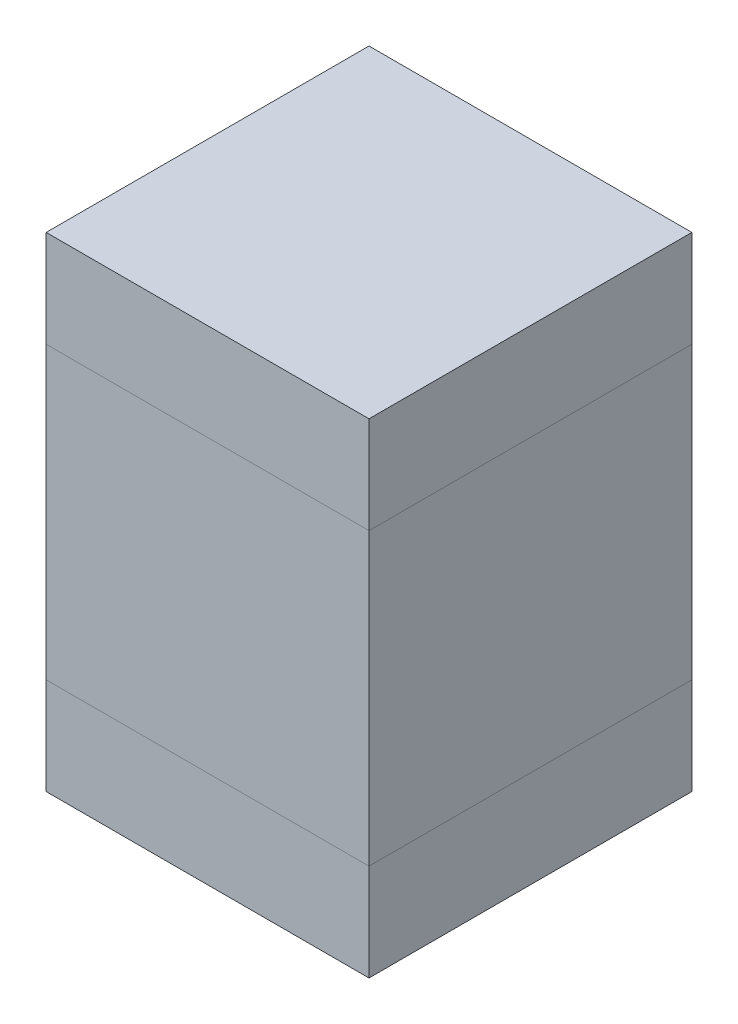
ISO-10303-21;
HEADER;
FILE_DESCRIPTION(('STEP AP214'),'2;1');
FILE_NAME('part.step','',(''),(''),'','','');
FILE_SCHEMA(('AUTOMOTIVE_DESIGN { 1 0 10303 214 1 1 1 1 }'));
ENDSEC;
DATA;
#1=APPLICATION_CONTEXT('core data for automotive mechanical design processes');
#2=APPLICATION_PROTOCOL_DEFINITION('international standard','automotive_design',2000,#1);
#3=PRODUCT_CONTEXT('',#1,'mechanical');
#4=PRODUCT('Part','Part','',(#3));
#5=PRODUCT_RELATED_PRODUCT_CATEGORY('part','',(#4));
#6=PRODUCT_DEFINITION_FORMATION('','',#4);
#7=PRODUCT_DEFINITION_CONTEXT('part definition',#1,'design');
#8=PRODUCT_DEFINITION('design','',#6,#7);
#9=PRODUCT_DEFINITION_SHAPE('','',#8);
#10=(LENGTH_UNIT() NAMED_UNIT(*) SI_UNIT(.MILLI.,.METRE.));
#11=(NAMED_UNIT(*) PLANE_ANGLE_UNIT() SI_UNIT($,.RADIAN.));
#12=(NAMED_UNIT(*) SI_UNIT($,.STERADIAN.) SOLID_ANGLE_UNIT());
#13=UNCERTAINTY_MEASURE_WITH_UNIT(LENGTH_MEASURE(1.E-05),#10,'distance_accuracy_value','');
#14=(GEOMETRIC_REPRESENTATION_CONTEXT(3) GLOBAL_UNCERTAINTY_ASSIGNED_CONTEXT((#13)) GLOBAL_UNIT_ASSIGNED_CONTEXT((#10,
#11,#12)) REPRESENTATION_CONTEXT('',''));
#15=CARTESIAN_POINT('',(0.,0.,0.));
#16=DIRECTION('',(0.,0.,1.));
#17=DIRECTION('',(1.,0.,0.));
#18=AXIS2_PLACEMENT_3D('',#15,#16,#17);
#19=CARTESIAN_POINT('',(25.,75.,25.));
#20=DIRECTION('',(-1.,0.,0.));
#21=DIRECTION('',(0.,0.,1.));
#22=AXIS2_PLACEMENT_3D('',#19,#20,#21);
#23=PLANE('',#22);
#24=DIRECTION('',(0.,0.,-1.));
#25=VECTOR('',#24,1.);
#26=CARTESIAN_POINT('',(25.,60.,25.));
#27=LINE('',#26,#25);
#28=CARTESIAN_POINT('',(25.,60.,25.));
#29=VERTEX_POINT('',#28);
#30=CARTESIAN_POINT('',(25.,60.,-25.));
#31=VERTEX_POINT('',#30);
#32=EDGE_CURVE('E121',#29,#31,#27,.T.);
#33=ORIENTED_EDGE('',*,*,#32,.T.);
#34=DIRECTION('',(0.,-1.,0.));
#35=VECTOR('',#34,1.);
#36=CARTESIAN_POINT('',(25.,75.,-25.));
#37=LINE('',#36,#35);
#38=CARTESIAN_POINT('',(25.,75.,-25.));
#39=VERTEX_POINT('',#38);
#40=EDGE_CURVE('E12',#39,#31,#37,.T.);
#41=ORIENTED_EDGE('',*,*,#40,.F.);
#42=DIRECTION('',(0.,0.,-1.));
#43=VECTOR('',#42,1.);
#44=CARTESIAN_POINT('',(25.,75.,25.));
#45=LINE('',#44,#43);
#46=CARTESIAN_POINT('',(25.,75.,25.));
#47=VERTEX_POINT('',#46);
#48=EDGE_CURVE('E109',#47,#39,#45,.T.);
#49=ORIENTED_EDGE('',*,*,#48,.F.);
#50=DIRECTION('',(0.,-1.,0.));
#51=VECTOR('',#50,1.);
#52=CARTESIAN_POINT('',(25.,75.,25.));
#53=LINE('',#52,#51);
#54=EDGE_CURVE('E117',#47,#29,#53,.T.);
#55=ORIENTED_EDGE('',*,*,#54,.T.);
#56=EDGE_LOOP('',(#33,#41,#49,#55));
#57=FACE_BOUND('',#56,.T.);
#58=ADVANCED_FACE('F58',(#57),#23,.F.);
#59=CARTESIAN_POINT('',(-25.,75.,-25.));
#60=DIRECTION('',(0.,0.,1.));
#61=DIRECTION('',(1.,0.,0.));
#62=AXIS2_PLACEMENT_3D('',#59,#60,#61);
#63=PLANE('',#62);
#64=DIRECTION('',(-1.,0.,0.));
#65=VECTOR('',#64,1.);
#66=CARTESIAN_POINT('',(-25.,60.,-25.));
#67=LINE('',#66,#65);
#68=CARTESIAN_POINT('',(-25.,60.,-25.));
#69=VERTEX_POINT('',#68);
#70=EDGE_CURVE('E113',#31,#69,#67,.T.);
#71=ORIENTED_EDGE('',*,*,#70,.T.);
#72=DIRECTION('',(0.,-1.,0.));
#73=VECTOR('',#72,1.);
#74=CARTESIAN_POINT('',(-25.,75.,-25.));
#75=LINE('',#74,#73);
#76=CARTESIAN_POINT('',(-25.,75.,-25.));
#77=VERTEX_POINT('',#76);
#78=EDGE_CURVE('E66',#77,#69,#75,.T.);
#79=ORIENTED_EDGE('',*,*,#78,.F.);
#80=DIRECTION('',(-1.,0.,0.));
#81=VECTOR('',#80,1.);
#82=CARTESIAN_POINT('',(-25.,75.,-25.));
#83=LINE('',#82,#81);
#84=EDGE_CURVE('E104',#39,#77,#83,.T.);
#85=ORIENTED_EDGE('',*,*,#84,.F.);
#86=ORIENTED_EDGE('',*,*,#40,.T.);
#87=EDGE_LOOP('',(#71,#79,#85,#86));
#88=FACE_BOUND('',#87,.T.);
#89=ADVANCED_FACE('F112',(#88),#63,.F.);
#90=CARTESIAN_POINT('',(-25.,75.,25.));
#91=DIRECTION('',(1.,0.,0.));
#92=DIRECTION('',(0.,0.,-1.));
#93=AXIS2_PLACEMENT_3D('',#90,#91,#92);
#94=PLANE('',#93);
#95=DIRECTION('',(0.,0.,1.));
#96=VECTOR('',#95,1.);
#97=CARTESIAN_POINT('',(-25.,60.,25.));
#98=LINE('',#97,#96);
#99=CARTESIAN_POINT('',(-25.,60.,25.));
#100=VERTEX_POINT('',#99);
#101=EDGE_CURVE('E91',#69,#100,#98,.T.);
#102=ORIENTED_EDGE('',*,*,#101,.T.);
#103=DIRECTION('',(0.,-1.,0.));
#104=VECTOR('',#103,1.);
#105=CARTESIAN_POINT('',(-25.,75.,25.));
#106=LINE('',#105,#104);
#107=CARTESIAN_POINT('',(-25.,75.,25.));
#108=VERTEX_POINT('',#107);
#109=EDGE_CURVE('E114',#108,#100,#106,.T.);
#110=ORIENTED_EDGE('',*,*,#109,.F.);
#111=DIRECTION('',(0.,0.,1.));
#112=VECTOR('',#111,1.);
#113=CARTESIAN_POINT('',(-25.,75.,25.));
#114=LINE('',#113,#112);
#115=EDGE_CURVE('E107',#77,#108,#114,.T.);
#116=ORIENTED_EDGE('',*,*,#115,.F.);
#117=ORIENTED_EDGE('',*,*,#78,.T.);
#118=EDGE_LOOP('',(#102,#110,#116,#117));
#119=FACE_BOUND('',#118,.T.);
#120=ADVANCED_FACE('F115',(#119),#94,.F.);
#121=CARTESIAN_POINT('',(-25.,75.,25.));
#122=DIRECTION('',(0.,0.,-1.));
#123=DIRECTION('',(-1.,0.,0.));
#124=AXIS2_PLACEMENT_3D('',#121,#122,#123);
#125=PLANE('',#124);
#126=DIRECTION('',(1.,0.,0.));
#127=VECTOR('',#126,1.);
#128=CARTESIAN_POINT('',(-25.,60.,25.));
#129=LINE('',#128,#127);
#130=EDGE_CURVE('E97',#100,#29,#129,.T.);
#131=ORIENTED_EDGE('',*,*,#130,.T.);
#132=ORIENTED_EDGE('',*,*,#54,.F.);
#133=DIRECTION('',(1.,0.,0.));
#134=VECTOR('',#133,1.);
#135=CARTESIAN_POINT('',(-25.,75.,25.));
#136=LINE('',#135,#134);
#137=EDGE_CURVE('E74',#108,#47,#136,.T.);
#138=ORIENTED_EDGE('',*,*,#137,.F.);
#139=ORIENTED_EDGE('',*,*,#109,.T.);
#140=EDGE_LOOP('',(#131,#132,#138,#139));
#141=FACE_BOUND('',#140,.T.);
#142=ADVANCED_FACE('F128',(#141),#125,.F.);
#143=CARTESIAN_POINT('',(0.,75.,0.));
#144=DIRECTION('',(0.,-1.,0.));
#145=DIRECTION('',(0.,0.,-1.));
#146=AXIS2_PLACEMENT_3D('',#143,#144,#145);
#147=PLANE('',#146);
#148=ORIENTED_EDGE('',*,*,#48,.T.);
#149=ORIENTED_EDGE('',*,*,#84,.T.);
#150=ORIENTED_EDGE('',*,*,#115,.T.);
#151=ORIENTED_EDGE('',*,*,#137,.T.);
#152=EDGE_LOOP('',(#148,#149,#150,#151));
#153=FACE_BOUND('',#152,.T.);
#154=ADVANCED_FACE('F105',(#153),#147,.F.);
#155=CARTESIAN_POINT('',(0.,60.,0.));
#156=DIRECTION('',(0.,-1.,0.));
#157=DIRECTION('',(0.,0.,-1.));
#158=AXIS2_PLACEMENT_3D('',#155,#156,#157);
#159=PLANE('',#158);
#160=ORIENTED_EDGE('',*,*,#32,.F.);
#161=ORIENTED_EDGE('',*,*,#130,.F.);
#162=ORIENTED_EDGE('',*,*,#101,.F.);
#163=ORIENTED_EDGE('',*,*,#70,.F.);
#164=EDGE_LOOP('',(#160,#161,#162,#163));
#165=FACE_BOUND('',#164,.T.);
#166=ADVANCED_FACE('F131',(#165),#159,.T.);
#167=CLOSED_SHELL('',(#58,#89,#120,#142,#154,#166));
#168=MANIFOLD_SOLID_BREP('B2',#167);
#169=CARTESIAN_POINT('',(25.,60.,25.));
#170=DIRECTION('',(-1.,0.,0.));
#171=DIRECTION('',(0.,0.,1.));
#172=AXIS2_PLACEMENT_3D('',#169,#170,#171);
#173=PLANE('',#172);
#174=DIRECTION('',(0.,0.,-1.));
#175=VECTOR('',#174,1.);
#176=CARTESIAN_POINT('',(25.,15.,25.));
#177=LINE('',#176,#175);
#178=CARTESIAN_POINT('',(25.,15.,25.));
#179=VERTEX_POINT('',#178);
#180=CARTESIAN_POINT('',(25.,15.,-25.));
#181=VERTEX_POINT('',#180);
#182=EDGE_CURVE('E259',#179,#181,#177,.T.);
#183=ORIENTED_EDGE('',*,*,#182,.T.);
#184=DIRECTION('',(0.,-1.,0.));
#185=VECTOR('',#184,1.);
#186=CARTESIAN_POINT('',(25.,60.,-25.));
#187=LINE('',#186,#185);
#188=CARTESIAN_POINT('',(25.,60.,-25.));
#189=VERTEX_POINT('',#188);
#190=EDGE_CURVE('E56',#189,#181,#187,.T.);
#191=ORIENTED_EDGE('',*,*,#190,.F.);
#192=DIRECTION('',(0.,0.,-1.));
#193=VECTOR('',#192,1.);
#194=CARTESIAN_POINT('',(25.,60.,25.));
#195=LINE('',#194,#193);
#196=CARTESIAN_POINT('',(25.,60.,25.));
#197=VERTEX_POINT('',#196);
#198=EDGE_CURVE('E243',#197,#189,#195,.T.);
#199=ORIENTED_EDGE('',*,*,#198,.F.);
#200=DIRECTION('',(0.,-1.,0.));
#201=VECTOR('',#200,1.);
#202=CARTESIAN_POINT('',(25.,60.,25.));
#203=LINE('',#202,#201);
#204=EDGE_CURVE('E255',#197,#179,#203,.T.);
#205=ORIENTED_EDGE('',*,*,#204,.T.);
#206=EDGE_LOOP('',(#183,#191,#199,#205));
#207=FACE_BOUND('',#206,.T.);
#208=ADVANCED_FACE('F191',(#207),#173,.F.);
#209=CARTESIAN_POINT('',(-25.,60.,-25.));
#210=DIRECTION('',(0.,0.,1.));
#211=DIRECTION('',(1.,0.,0.));
#212=AXIS2_PLACEMENT_3D('',#209,#210,#211);
#213=PLANE('',#212);
#214=DIRECTION('',(-1.,0.,0.));
#215=VECTOR('',#214,1.);
#216=CARTESIAN_POINT('',(-25.,15.,-25.));
#217=LINE('',#216,#215);
#218=CARTESIAN_POINT('',(-25.,15.,-25.));
#219=VERTEX_POINT('',#218);
#220=EDGE_CURVE('E248',#181,#219,#217,.T.);
#221=ORIENTED_EDGE('',*,*,#220,.T.);
#222=DIRECTION('',(0.,-1.,0.));
#223=VECTOR('',#222,1.);
#224=CARTESIAN_POINT('',(-25.,60.,-25.));
#225=LINE('',#224,#223);
#226=CARTESIAN_POINT('',(-25.,60.,-25.));
#227=VERTEX_POINT('',#226);
#228=EDGE_CURVE('E200',#227,#219,#225,.T.);
#229=ORIENTED_EDGE('',*,*,#228,.F.);
#230=DIRECTION('',(-1.,0.,0.));
#231=VECTOR('',#230,1.);
#232=CARTESIAN_POINT('',(-25.,60.,-25.));
#233=LINE('',#232,#231);
#234=EDGE_CURVE('E238',#189,#227,#233,.T.);
#235=ORIENTED_EDGE('',*,*,#234,.F.);
#236=ORIENTED_EDGE('',*,*,#190,.T.);
#237=EDGE_LOOP('',(#221,#229,#235,#236));
#238=FACE_BOUND('',#237,.T.);
#239=ADVANCED_FACE('F247',(#238),#213,.F.);
#240=CARTESIAN_POINT('',(-25.,60.,25.));
#241=DIRECTION('',(1.,0.,0.));
#242=DIRECTION('',(0.,0.,-1.));
#243=AXIS2_PLACEMENT_3D('',#240,#241,#242);
#244=PLANE('',#243);
#245=DIRECTION('',(0.,0.,1.));
#246=VECTOR('',#245,1.);
#247=CARTESIAN_POINT('',(-25.,15.,25.));
#248=LINE('',#247,#246);
#249=CARTESIAN_POINT('',(-25.,15.,25.));
#250=VERTEX_POINT('',#249);
#251=EDGE_CURVE('E225',#219,#250,#248,.T.);
#252=ORIENTED_EDGE('',*,*,#251,.T.);
#253=DIRECTION('',(0.,-1.,0.));
#254=VECTOR('',#253,1.);
#255=CARTESIAN_POINT('',(-25.,60.,25.));
#256=LINE('',#255,#254);
#257=CARTESIAN_POINT('',(-25.,60.,25.));
#258=VERTEX_POINT('',#257);
#259=EDGE_CURVE('E250',#258,#250,#256,.T.);
#260=ORIENTED_EDGE('',*,*,#259,.F.);
#261=DIRECTION('',(0.,0.,1.));
#262=VECTOR('',#261,1.);
#263=CARTESIAN_POINT('',(-25.,60.,25.));
#264=LINE('',#263,#262);
#265=EDGE_CURVE('E241',#227,#258,#264,.T.);
#266=ORIENTED_EDGE('',*,*,#265,.F.);
#267=ORIENTED_EDGE('',*,*,#228,.T.);
#268=EDGE_LOOP('',(#252,#260,#266,#267));
#269=FACE_BOUND('',#268,.T.);
#270=ADVANCED_FACE('F251',(#269),#244,.F.);
#271=CARTESIAN_POINT('',(-25.,60.,25.));
#272=DIRECTION('',(0.,0.,-1.));
#273=DIRECTION('',(-1.,0.,0.));
#274=AXIS2_PLACEMENT_3D('',#271,#272,#273);
#275=PLANE('',#274);
#276=DIRECTION('',(1.,0.,0.));
#277=VECTOR('',#276,1.);
#278=CARTESIAN_POINT('',(-25.,15.,25.));
#279=LINE('',#278,#277);
#280=EDGE_CURVE('E231',#250,#179,#279,.T.);
#281=ORIENTED_EDGE('',*,*,#280,.T.);
#282=ORIENTED_EDGE('',*,*,#204,.F.);
#283=DIRECTION('',(1.,0.,0.));
#284=VECTOR('',#283,1.);
#285=CARTESIAN_POINT('',(-25.,60.,25.));
#286=LINE('',#285,#284);
#287=EDGE_CURVE('E208',#258,#197,#286,.T.);
#288=ORIENTED_EDGE('',*,*,#287,.F.);
#289=ORIENTED_EDGE('',*,*,#259,.T.);
#290=EDGE_LOOP('',(#281,#282,#288,#289));
#291=FACE_BOUND('',#290,.T.);
#292=ADVANCED_FACE('F272',(#291),#275,.F.);
#293=CARTESIAN_POINT('',(0.,60.,0.));
#294=DIRECTION('',(0.,-1.,0.));
#295=DIRECTION('',(0.,0.,-1.));
#296=AXIS2_PLACEMENT_3D('',#293,#294,#295);
#297=PLANE('',#296);
#298=ORIENTED_EDGE('',*,*,#198,.T.);
#299=ORIENTED_EDGE('',*,*,#234,.T.);
#300=ORIENTED_EDGE('',*,*,#265,.T.);
#301=ORIENTED_EDGE('',*,*,#287,.T.);
#302=EDGE_LOOP('',(#298,#299,#300,#301));
#303=FACE_BOUND('',#302,.T.);
#304=ADVANCED_FACE('F239',(#303),#297,.F.);
#305=CARTESIAN_POINT('',(0.,15.,0.));
#306=DIRECTION('',(0.,-1.,0.));
#307=DIRECTION('',(0.,0.,-1.));
#308=AXIS2_PLACEMENT_3D('',#305,#306,#307);
#309=PLANE('',#308);
#310=ORIENTED_EDGE('',*,*,#182,.F.);
#311=ORIENTED_EDGE('',*,*,#280,.F.);
#312=ORIENTED_EDGE('',*,*,#251,.F.);
#313=ORIENTED_EDGE('',*,*,#220,.F.);
#314=EDGE_LOOP('',(#310,#311,#312,#313));
#315=FACE_BOUND('',#314,.T.);
#316=ADVANCED_FACE('F275',(#315),#309,.T.);
#317=CLOSED_SHELL('',(#208,#239,#270,#292,#304,#316));
#318=MANIFOLD_SOLID_BREP('B6',#317);
#319=CARTESIAN_POINT('',(25.,15.,25.));
#320=DIRECTION('',(-1.,0.,0.));
#321=DIRECTION('',(0.,0.,1.));
#322=AXIS2_PLACEMENT_3D('',#319,#320,#321);
#323=PLANE('',#322);
#324=DIRECTION('',(0.,0.,-1.));
#325=VECTOR('',#324,1.);
#326=CARTESIAN_POINT('',(25.,0.,25.));
#327=LINE('',#326,#325);
#328=CARTESIAN_POINT('',(25.,0.,25.));
#329=VERTEX_POINT('',#328);
#330=CARTESIAN_POINT('',(25.,0.,-25.));
#331=VERTEX_POINT('',#330);
#332=EDGE_CURVE('E390',#329,#331,#327,.T.);
#333=ORIENTED_EDGE('',*,*,#332,.T.);
#334=DIRECTION('',(0.,-1.,0.));
#335=VECTOR('',#334,1.);
#336=CARTESIAN_POINT('',(25.,15.,-25.));
#337=LINE('',#336,#335);
#338=CARTESIAN_POINT('',(25.,15.,-25.));
#339=VERTEX_POINT('',#338);
#340=EDGE_CURVE('E189',#339,#331,#337,.T.);
#341=ORIENTED_EDGE('',*,*,#340,.F.);
#342=DIRECTION('',(0.,0.,-1.));
#343=VECTOR('',#342,1.);
#344=CARTESIAN_POINT('',(25.,15.,25.));
#345=LINE('',#344,#343);
#346=CARTESIAN_POINT('',(25.,15.,25.));
#347=VERTEX_POINT('',#346);
#348=EDGE_CURVE('E378',#347,#339,#345,.T.);
#349=ORIENTED_EDGE('',*,*,#348,.F.);
#350=DIRECTION('',(0.,-1.,0.));
#351=VECTOR('',#350,1.);
#352=CARTESIAN_POINT('',(25.,15.,25.));
#353=LINE('',#352,#351);
#354=EDGE_CURVE('E386',#347,#329,#353,.T.);
#355=ORIENTED_EDGE('',*,*,#354,.T.);
#356=EDGE_LOOP('',(#333,#341,#349,#355));
#357=FACE_BOUND('',#356,.T.);
#358=ADVANCED_FACE('F327',(#357),#323,.F.);
#359=CARTESIAN_POINT('',(-25.,15.,-25.));
#360=DIRECTION('',(0.,0.,1.));
#361=DIRECTION('',(1.,0.,0.));
#362=AXIS2_PLACEMENT_3D('',#359,#360,#361);
#363=PLANE('',#362);
#364=DIRECTION('',(-1.,0.,0.));
#365=VECTOR('',#364,1.);
#366=CARTESIAN_POINT('',(-25.,0.,-25.));
#367=LINE('',#366,#365);
#368=CARTESIAN_POINT('',(-25.,0.,-25.));
#369=VERTEX_POINT('',#368);
#370=EDGE_CURVE('E382',#331,#369,#367,.T.);
#371=ORIENTED_EDGE('',*,*,#370,.T.);
#372=DIRECTION('',(0.,-1.,0.));
#373=VECTOR('',#372,1.);
#374=CARTESIAN_POINT('',(-25.,15.,-25.));
#375=LINE('',#374,#373);
#376=CARTESIAN_POINT('',(-25.,15.,-25.));
#377=VERTEX_POINT('',#376);
#378=EDGE_CURVE('E335',#377,#369,#375,.T.);
#379=ORIENTED_EDGE('',*,*,#378,.F.);
#380=DIRECTION('',(-1.,0.,0.));
#381=VECTOR('',#380,1.);
#382=CARTESIAN_POINT('',(-25.,15.,-25.));
#383=LINE('',#382,#381);
#384=EDGE_CURVE('E373',#339,#377,#383,.T.);
#385=ORIENTED_EDGE('',*,*,#384,.F.);
#386=ORIENTED_EDGE('',*,*,#340,.T.);
#387=EDGE_LOOP('',(#371,#379,#385,#386));
#388=FACE_BOUND('',#387,.T.);
#389=ADVANCED_FACE('F381',(#388),#363,.F.);
#390=CARTESIAN_POINT('',(-25.,15.,25.));
#391=DIRECTION('',(1.,0.,0.));
#392=DIRECTION('',(0.,0.,-1.));
#393=AXIS2_PLACEMENT_3D('',#390,#391,#392);
#394=PLANE('',#393);
#395=DIRECTION('',(0.,0.,1.));
#396=VECTOR('',#395,1.);
#397=CARTESIAN_POINT('',(-25.,0.,25.));
#398=LINE('',#397,#396);
#399=CARTESIAN_POINT('',(-25.,0.,25.));
#400=VERTEX_POINT('',#399);
#401=EDGE_CURVE('E360',#369,#400,#398,.T.);
#402=ORIENTED_EDGE('',*,*,#401,.T.);
#403=DIRECTION('',(0.,-1.,0.));
#404=VECTOR('',#403,1.);
#405=CARTESIAN_POINT('',(-25.,15.,25.));
#406=LINE('',#405,#404);
#407=CARTESIAN_POINT('',(-25.,15.,25.));
#408=VERTEX_POINT('',#407);
#409=EDGE_CURVE('E383',#408,#400,#406,.T.);
#410=ORIENTED_EDGE('',*,*,#409,.F.);
#411=DIRECTION('',(0.,0.,1.));
#412=VECTOR('',#411,1.);
#413=CARTESIAN_POINT('',(-25.,15.,25.));
#414=LINE('',#413,#412);
#415=EDGE_CURVE('E376',#377,#408,#414,.T.);
#416=ORIENTED_EDGE('',*,*,#415,.F.);
#417=ORIENTED_EDGE('',*,*,#378,.T.);
#418=EDGE_LOOP('',(#402,#410,#416,#417));
#419=FACE_BOUND('',#418,.T.);
#420=ADVANCED_FACE('F384',(#419),#394,.F.);
#421=CARTESIAN_POINT('',(-25.,15.,25.));
#422=DIRECTION('',(0.,0.,-1.));
#423=DIRECTION('',(-1.,0.,0.));
#424=AXIS2_PLACEMENT_3D('',#421,#422,#423);
#425=PLANE('',#424);
#426=DIRECTION('',(1.,0.,0.));
#427=VECTOR('',#426,1.);
#428=CARTESIAN_POINT('',(-25.,0.,25.));
#429=LINE('',#428,#427);
#430=EDGE_CURVE('E366',#400,#329,#429,.T.);
#431=ORIENTED_EDGE('',*,*,#430,.T.);
#432=ORIENTED_EDGE('',*,*,#354,.F.);
#433=DIRECTION('',(1.,0.,0.));
#434=VECTOR('',#433,1.);
#435=CARTESIAN_POINT('',(-25.,15.,25.));
#436=LINE('',#435,#434);
#437=EDGE_CURVE('E343',#408,#347,#436,.T.);
#438=ORIENTED_EDGE('',*,*,#437,.F.);
#439=ORIENTED_EDGE('',*,*,#409,.T.);
#440=EDGE_LOOP('',(#431,#432,#438,#439));
#441=FACE_BOUND('',#440,.T.);
#442=ADVANCED_FACE('F397',(#441),#425,.F.);
#443=CARTESIAN_POINT('',(0.,15.,0.));
#444=DIRECTION('',(0.,-1.,0.));
#445=DIRECTION('',(0.,0.,-1.));
#446=AXIS2_PLACEMENT_3D('',#443,#444,#445);
#447=PLANE('',#446);
#448=ORIENTED_EDGE('',*,*,#348,.T.);
#449=ORIENTED_EDGE('',*,*,#384,.T.);
#450=ORIENTED_EDGE('',*,*,#415,.T.);
#451=ORIENTED_EDGE('',*,*,#437,.T.);
#452=EDGE_LOOP('',(#448,#449,#450,#451));
#453=FACE_BOUND('',#452,.T.);
#454=ADVANCED_FACE('F374',(#453),#447,.F.);
#455=CARTESIAN_POINT('',(0.,0.,0.));
#456=DIRECTION('',(0.,-1.,0.));
#457=DIRECTION('',(0.,0.,-1.));
#458=AXIS2_PLACEMENT_3D('',#455,#456,#457);
#459=PLANE('',#458);
#460=ORIENTED_EDGE('',*,*,#332,.F.);
#461=ORIENTED_EDGE('',*,*,#430,.F.);
#462=ORIENTED_EDGE('',*,*,#401,.F.);
#463=ORIENTED_EDGE('',*,*,#370,.F.);
#464=EDGE_LOOP('',(#460,#461,#462,#463));
#465=FACE_BOUND('',#464,.T.);
#466=ADVANCED_FACE('F400',(#465),#459,.T.);
#467=CLOSED_SHELL('',(#358,#389,#420,#442,#454,#466));
#468=MANIFOLD_SOLID_BREP('B50',#467);
#469=ADVANCED_BREP_SHAPE_REPRESENTATION('',(#18,#168,#318,#468),#14);
#470=SHAPE_DEFINITION_REPRESENTATION(#9,#469);
ENDSEC;
END-ISO-10303-21;
